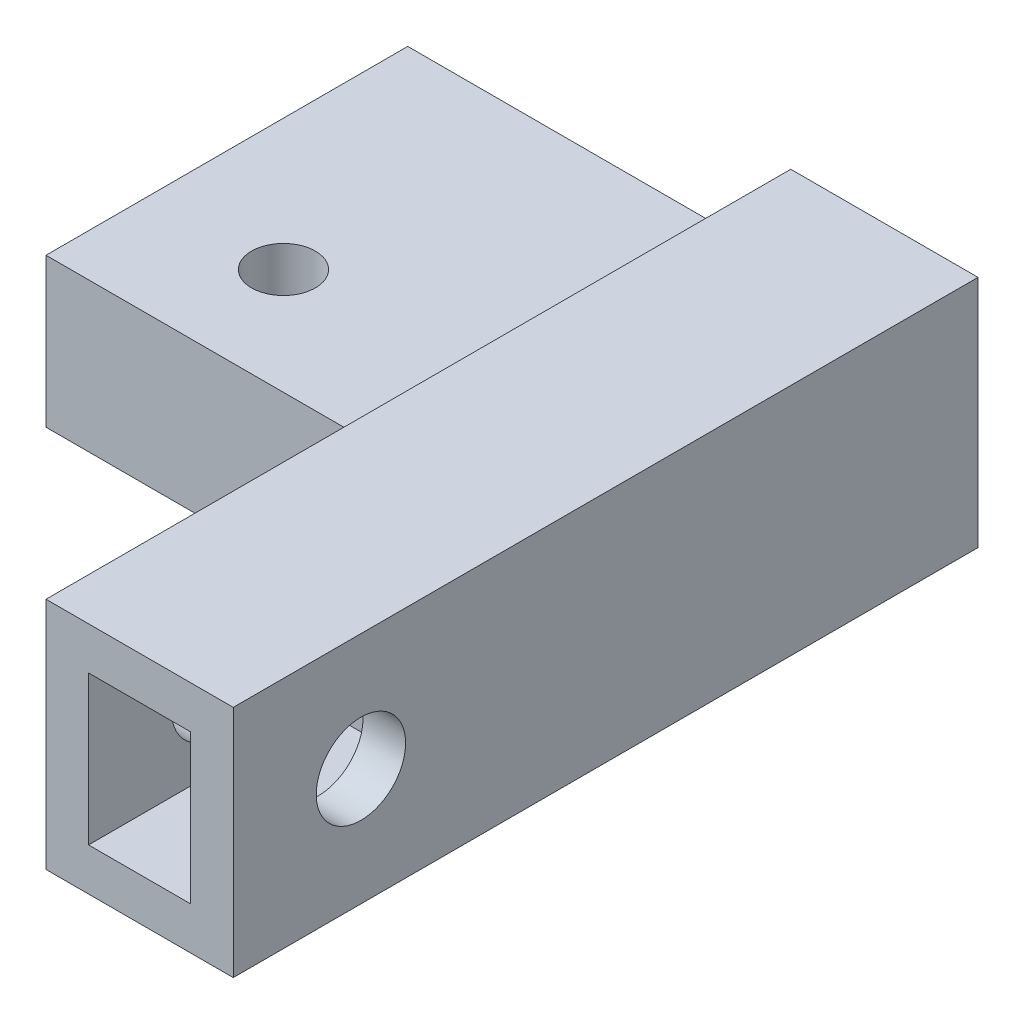
ISO-10303-21;
HEADER;
FILE_DESCRIPTION(('STEP AP214'),'2;1');
FILE_NAME('part.step','',(''),(''),'','','');
FILE_SCHEMA(('AUTOMOTIVE_DESIGN { 1 0 10303 214 1 1 1 1 }'));
ENDSEC;
DATA;
#1=APPLICATION_CONTEXT('core data for automotive mechanical design processes');
#2=APPLICATION_PROTOCOL_DEFINITION('international standard','automotive_design',2000,#1);
#3=PRODUCT_CONTEXT('',#1,'mechanical');
#4=PRODUCT('Part','Part','',(#3));
#5=PRODUCT_RELATED_PRODUCT_CATEGORY('part','',(#4));
#6=PRODUCT_DEFINITION_FORMATION('','',#4);
#7=PRODUCT_DEFINITION_CONTEXT('part definition',#1,'design');
#8=PRODUCT_DEFINITION('design','',#6,#7);
#9=PRODUCT_DEFINITION_SHAPE('','',#8);
#10=(LENGTH_UNIT() NAMED_UNIT(*) SI_UNIT(.MILLI.,.METRE.));
#11=(NAMED_UNIT(*) PLANE_ANGLE_UNIT() SI_UNIT($,.RADIAN.));
#12=(NAMED_UNIT(*) SI_UNIT($,.STERADIAN.) SOLID_ANGLE_UNIT());
#13=UNCERTAINTY_MEASURE_WITH_UNIT(LENGTH_MEASURE(1.E-05),#10,'distance_accuracy_value','');
#14=(GEOMETRIC_REPRESENTATION_CONTEXT(3) GLOBAL_UNCERTAINTY_ASSIGNED_CONTEXT((#13)) GLOBAL_UNIT_ASSIGNED_CONTEXT((#10,
#11,#12)) REPRESENTATION_CONTEXT('',''));
#15=CARTESIAN_POINT('',(0.,0.,0.));
#16=DIRECTION('',(0.,0.,1.));
#17=DIRECTION('',(1.,0.,0.));
#18=AXIS2_PLACEMENT_3D('',#15,#16,#17);
#19=CARTESIAN_POINT('',(4.4,5.5,-35.));
#20=DIRECTION('',(1.,0.,0.));
#21=DIRECTION('',(0.,1.,0.));
#22=AXIS2_PLACEMENT_3D('',#19,#20,#21);
#23=PLANE('',#22);
#24=CARTESIAN_POINT('',(4.40000000000001,0.,-6.));
#25=DIRECTION('',(1.,0.,0.));
#26=DIRECTION('',(0.,1.,0.));
#27=AXIS2_PLACEMENT_3D('',#24,#25,#26);
#28=CIRCLE('',#27,2.1);
#29=CARTESIAN_POINT('',(4.40000000000001,2.1,-6.));
#30=VERTEX_POINT('',#29);
#31=EDGE_CURVE('E166',#30,#30,#28,.T.);
#32=ORIENTED_EDGE('',*,*,#31,.F.);
#33=EDGE_LOOP('',(#32));
#34=FACE_BOUND('',#33,.T.);
#35=DIRECTION('',(0.,1.,0.));
#36=VECTOR('',#35,1.);
#37=CARTESIAN_POINT('',(4.4,5.5,0.));
#38=LINE('',#37,#36);
#39=CARTESIAN_POINT('',(4.40000000000001,-5.50000000000001,0.));
#40=VERTEX_POINT('',#39);
#41=CARTESIAN_POINT('',(4.4,5.5,0.));
#42=VERTEX_POINT('',#41);
#43=EDGE_CURVE('E195',#40,#42,#38,.T.);
#44=ORIENTED_EDGE('',*,*,#43,.F.);
#45=DIRECTION('',(0.,0.,1.));
#46=VECTOR('',#45,1.);
#47=CARTESIAN_POINT('',(4.40000000000001,-5.50000000000001,-35.));
#48=LINE('',#47,#46);
#49=CARTESIAN_POINT('',(4.40000000000001,-5.50000000000001,-35.));
#50=VERTEX_POINT('',#49);
#51=EDGE_CURVE('E11',#50,#40,#48,.T.);
#52=ORIENTED_EDGE('',*,*,#51,.F.);
#53=DIRECTION('',(0.,1.,0.));
#54=VECTOR('',#53,1.);
#55=CARTESIAN_POINT('',(4.4,5.5,-35.));
#56=LINE('',#55,#54);
#57=CARTESIAN_POINT('',(4.4,5.5,-35.));
#58=VERTEX_POINT('',#57);
#59=EDGE_CURVE('E125',#50,#58,#56,.T.);
#60=ORIENTED_EDGE('',*,*,#59,.T.);
#61=DIRECTION('',(0.,0.,1.));
#62=VECTOR('',#61,1.);
#63=CARTESIAN_POINT('',(4.4,5.5,-35.));
#64=LINE('',#63,#62);
#65=EDGE_CURVE('E127',#58,#42,#64,.T.);
#66=ORIENTED_EDGE('',*,*,#65,.T.);
#67=EDGE_LOOP('',(#44,#52,#60,#66));
#68=FACE_BOUND('',#67,.T.);
#69=ADVANCED_FACE('F34',(#34,#68),#23,.T.);
#70=CARTESIAN_POINT('',(-4.4,-5.50000000000001,-35.));
#71=DIRECTION('',(0.,-1.,0.));
#72=DIRECTION('',(0.,0.,-1.));
#73=AXIS2_PLACEMENT_3D('',#70,#71,#72);
#74=PLANE('',#73);
#75=DIRECTION('',(1.,0.,0.));
#76=VECTOR('',#75,1.);
#77=CARTESIAN_POINT('',(-4.4,-5.50000000000001,0.));
#78=LINE('',#77,#76);
#79=CARTESIAN_POINT('',(-4.4,-5.50000000000001,0.));
#80=VERTEX_POINT('',#79);
#81=EDGE_CURVE('E204',#80,#40,#78,.T.);
#82=ORIENTED_EDGE('',*,*,#81,.F.);
#83=DIRECTION('',(0.,0.,1.));
#84=VECTOR('',#83,1.);
#85=CARTESIAN_POINT('',(-4.4,-5.50000000000001,-35.));
#86=LINE('',#85,#84);
#87=CARTESIAN_POINT('',(-4.4,-5.50000000000001,-18.));
#88=VERTEX_POINT('',#87);
#89=EDGE_CURVE('E42',#88,#80,#86,.T.);
#90=ORIENTED_EDGE('',*,*,#89,.F.);
#91=DIRECTION('',(1.,0.,0.));
#92=VECTOR('',#91,1.);
#93=CARTESIAN_POINT('',(-22.4,-5.50000000000001,-18.));
#94=LINE('',#93,#92);
#95=CARTESIAN_POINT('',(-22.4,-5.50000000000001,-18.));
#96=VERTEX_POINT('',#95);
#97=EDGE_CURVE('E134',#96,#88,#94,.T.);
#98=ORIENTED_EDGE('',*,*,#97,.F.);
#99=DIRECTION('',(0.,0.,1.));
#100=VECTOR('',#99,1.);
#101=CARTESIAN_POINT('',(-22.4,-5.50000000000001,-35.));
#102=LINE('',#101,#100);
#103=CARTESIAN_POINT('',(-22.4,-5.50000000000001,-35.));
#104=VERTEX_POINT('',#103);
#105=EDGE_CURVE('E130',#104,#96,#102,.T.);
#106=ORIENTED_EDGE('',*,*,#105,.F.);
#107=DIRECTION('',(1.,0.,0.));
#108=VECTOR('',#107,1.);
#109=CARTESIAN_POINT('',(-4.4,-5.50000000000001,-35.));
#110=LINE('',#109,#108);
#111=EDGE_CURVE('E117',#104,#50,#110,.T.);
#112=ORIENTED_EDGE('',*,*,#111,.T.);
#113=ORIENTED_EDGE('',*,*,#51,.T.);
#114=EDGE_LOOP('',(#82,#90,#98,#106,#112,#113));
#115=FACE_BOUND('',#114,.T.);
#116=ADVANCED_FACE('F132',(#115),#74,.T.);
#117=CARTESIAN_POINT('',(-4.4,5.5,-35.));
#118=DIRECTION('',(-1.,0.,0.));
#119=DIRECTION('',(0.,-1.,0.));
#120=AXIS2_PLACEMENT_3D('',#117,#118,#119);
#121=PLANE('',#120);
#122=DIRECTION('',(0.,0.,-1.));
#123=VECTOR('',#122,1.);
#124=CARTESIAN_POINT('',(-4.4,1.49999999999999,-35.));
#125=LINE('',#124,#123);
#126=CARTESIAN_POINT('',(-4.4,1.49999999999999,-18.));
#127=VERTEX_POINT('',#126);
#128=CARTESIAN_POINT('',(-4.4,1.49999999999999,-35.));
#129=VERTEX_POINT('',#128);
#130=EDGE_CURVE('E143',#127,#129,#125,.T.);
#131=ORIENTED_EDGE('',*,*,#130,.F.);
#132=DIRECTION('',(0.,1.,0.));
#133=VECTOR('',#132,1.);
#134=CARTESIAN_POINT('',(-4.4,-5.50000000000001,-18.));
#135=LINE('',#134,#133);
#136=EDGE_CURVE('E50',#88,#127,#135,.T.);
#137=ORIENTED_EDGE('',*,*,#136,.F.);
#138=ORIENTED_EDGE('',*,*,#89,.T.);
#139=DIRECTION('',(0.,-1.,0.));
#140=VECTOR('',#139,1.);
#141=CARTESIAN_POINT('',(-4.4,5.5,0.));
#142=LINE('',#141,#140);
#143=CARTESIAN_POINT('',(-4.4,5.5,0.));
#144=VERTEX_POINT('',#143);
#145=EDGE_CURVE('E213',#144,#80,#142,.T.);
#146=ORIENTED_EDGE('',*,*,#145,.F.);
#147=DIRECTION('',(0.,0.,1.));
#148=VECTOR('',#147,1.);
#149=CARTESIAN_POINT('',(-4.4,5.5,-35.));
#150=LINE('',#149,#148);
#151=CARTESIAN_POINT('',(-4.4,5.5,-35.));
#152=VERTEX_POINT('',#151);
#153=EDGE_CURVE('E219',#152,#144,#150,.T.);
#154=ORIENTED_EDGE('',*,*,#153,.F.);
#155=DIRECTION('',(0.,-1.,0.));
#156=VECTOR('',#155,1.);
#157=CARTESIAN_POINT('',(-4.4,5.5,-35.));
#158=LINE('',#157,#156);
#159=EDGE_CURVE('E56',#152,#129,#158,.T.);
#160=ORIENTED_EDGE('',*,*,#159,.T.);
#161=EDGE_LOOP('',(#131,#137,#138,#146,#154,#160));
#162=FACE_BOUND('',#161,.T.);
#163=CARTESIAN_POINT('',(-4.4,0.,-6.));
#164=DIRECTION('',(-1.,0.,0.));
#165=DIRECTION('',(0.,-1.,0.));
#166=AXIS2_PLACEMENT_3D('',#163,#164,#165);
#167=CIRCLE('',#166,2.1);
#168=CARTESIAN_POINT('',(-4.4,-2.1,-6.));
#169=VERTEX_POINT('',#168);
#170=EDGE_CURVE('E160',#169,#169,#167,.T.);
#171=ORIENTED_EDGE('',*,*,#170,.F.);
#172=EDGE_LOOP('',(#171));
#173=FACE_BOUND('',#172,.T.);
#174=ADVANCED_FACE('F233',(#162,#173),#121,.T.);
#175=CARTESIAN_POINT('',(-4.4,5.5,-35.));
#176=DIRECTION('',(0.,1.,0.));
#177=DIRECTION('',(0.,0.,1.));
#178=AXIS2_PLACEMENT_3D('',#175,#176,#177);
#179=PLANE('',#178);
#180=DIRECTION('',(-1.,0.,0.));
#181=VECTOR('',#180,1.);
#182=CARTESIAN_POINT('',(-4.4,5.5,0.));
#183=LINE('',#182,#181);
#184=EDGE_CURVE('E210',#42,#144,#183,.T.);
#185=ORIENTED_EDGE('',*,*,#184,.F.);
#186=ORIENTED_EDGE('',*,*,#65,.F.);
#187=DIRECTION('',(-1.,0.,0.));
#188=VECTOR('',#187,1.);
#189=CARTESIAN_POINT('',(-4.4,5.5,-35.));
#190=LINE('',#189,#188);
#191=EDGE_CURVE('E203',#58,#152,#190,.T.);
#192=ORIENTED_EDGE('',*,*,#191,.T.);
#193=ORIENTED_EDGE('',*,*,#153,.T.);
#194=EDGE_LOOP('',(#185,#186,#192,#193));
#195=FACE_BOUND('',#194,.T.);
#196=ADVANCED_FACE('F224',(#195),#179,.T.);
#197=CARTESIAN_POINT('',(0.,0.,-35.));
#198=DIRECTION('',(0.,0.,1.));
#199=DIRECTION('',(1.,0.,0.));
#200=AXIS2_PLACEMENT_3D('',#197,#198,#199);
#201=PLANE('',#200);
#202=ORIENTED_EDGE('',*,*,#59,.F.);
#203=ORIENTED_EDGE('',*,*,#111,.F.);
#204=DIRECTION('',(0.,-1.,0.));
#205=VECTOR('',#204,1.);
#206=CARTESIAN_POINT('',(-22.4,-5.50000000000001,-35.));
#207=LINE('',#206,#205);
#208=CARTESIAN_POINT('',(-22.4,1.49999999999999,-35.));
#209=VERTEX_POINT('',#208);
#210=EDGE_CURVE('E122',#209,#104,#207,.T.);
#211=ORIENTED_EDGE('',*,*,#210,.F.);
#212=DIRECTION('',(1.,0.,0.));
#213=VECTOR('',#212,1.);
#214=CARTESIAN_POINT('',(-22.4,1.49999999999999,-35.));
#215=LINE('',#214,#213);
#216=EDGE_CURVE('E152',#209,#129,#215,.T.);
#217=ORIENTED_EDGE('',*,*,#216,.T.);
#218=ORIENTED_EDGE('',*,*,#159,.F.);
#219=ORIENTED_EDGE('',*,*,#191,.F.);
#220=EDGE_LOOP('',(#202,#203,#211,#217,#218,#219));
#221=FACE_BOUND('',#220,.T.);
#222=ADVANCED_FACE('F119',(#221),#201,.F.);
#223=CARTESIAN_POINT('',(0.,0.,0.));
#224=DIRECTION('',(0.,0.,1.));
#225=DIRECTION('',(1.,0.,0.));
#226=AXIS2_PLACEMENT_3D('',#223,#224,#225);
#227=PLANE('',#226);
#228=DIRECTION('',(0.,1.,0.));
#229=VECTOR('',#228,1.);
#230=CARTESIAN_POINT('',(2.4,3.5,0.));
#231=LINE('',#230,#229);
#232=CARTESIAN_POINT('',(2.4,-3.5,0.));
#233=VERTEX_POINT('',#232);
#234=CARTESIAN_POINT('',(2.4,3.5,0.));
#235=VERTEX_POINT('',#234);
#236=EDGE_CURVE('E169',#233,#235,#231,.T.);
#237=ORIENTED_EDGE('',*,*,#236,.F.);
#238=DIRECTION('',(1.,0.,0.));
#239=VECTOR('',#238,1.);
#240=CARTESIAN_POINT('',(-2.4,-3.5,0.));
#241=LINE('',#240,#239);
#242=CARTESIAN_POINT('',(-2.4,-3.5,0.));
#243=VERTEX_POINT('',#242);
#244=EDGE_CURVE('E174',#243,#233,#241,.T.);
#245=ORIENTED_EDGE('',*,*,#244,.F.);
#246=DIRECTION('',(0.,-1.,0.));
#247=VECTOR('',#246,1.);
#248=CARTESIAN_POINT('',(-2.4,3.5,0.));
#249=LINE('',#248,#247);
#250=CARTESIAN_POINT('',(-2.4,3.5,0.));
#251=VERTEX_POINT('',#250);
#252=EDGE_CURVE('E188',#251,#243,#249,.T.);
#253=ORIENTED_EDGE('',*,*,#252,.F.);
#254=DIRECTION('',(-1.,0.,0.));
#255=VECTOR('',#254,1.);
#256=CARTESIAN_POINT('',(-2.4,3.5,0.));
#257=LINE('',#256,#255);
#258=EDGE_CURVE('E185',#235,#251,#257,.T.);
#259=ORIENTED_EDGE('',*,*,#258,.F.);
#260=EDGE_LOOP('',(#237,#245,#253,#259));
#261=FACE_BOUND('',#260,.T.);
#262=ORIENTED_EDGE('',*,*,#43,.T.);
#263=ORIENTED_EDGE('',*,*,#184,.T.);
#264=ORIENTED_EDGE('',*,*,#145,.T.);
#265=ORIENTED_EDGE('',*,*,#81,.T.);
#266=EDGE_LOOP('',(#262,#263,#264,#265));
#267=FACE_BOUND('',#266,.T.);
#268=ADVANCED_FACE('F227',(#261,#267),#227,.T.);
#269=CARTESIAN_POINT('',(2.4,3.5,-11.));
#270=DIRECTION('',(1.,0.,0.));
#271=DIRECTION('',(0.,1.,0.));
#272=AXIS2_PLACEMENT_3D('',#269,#270,#271);
#273=PLANE('',#272);
#274=CARTESIAN_POINT('',(2.4,0.,-6.));
#275=DIRECTION('',(1.,0.,0.));
#276=DIRECTION('',(0.,1.,0.));
#277=AXIS2_PLACEMENT_3D('',#274,#275,#276);
#278=CIRCLE('',#277,2.1);
#279=CARTESIAN_POINT('',(2.4,2.1,-6.));
#280=VERTEX_POINT('',#279);
#281=EDGE_CURVE('E163',#280,#280,#278,.T.);
#282=ORIENTED_EDGE('',*,*,#281,.T.);
#283=EDGE_LOOP('',(#282));
#284=FACE_BOUND('',#283,.T.);
#285=ORIENTED_EDGE('',*,*,#236,.T.);
#286=DIRECTION('',(0.,0.,1.));
#287=VECTOR('',#286,1.);
#288=CARTESIAN_POINT('',(2.4,3.5,-11.));
#289=LINE('',#288,#287);
#290=CARTESIAN_POINT('',(2.4,3.5,-11.));
#291=VERTEX_POINT('',#290);
#292=EDGE_CURVE('E183',#291,#235,#289,.T.);
#293=ORIENTED_EDGE('',*,*,#292,.F.);
#294=DIRECTION('',(0.,1.,0.));
#295=VECTOR('',#294,1.);
#296=CARTESIAN_POINT('',(2.4,3.5,-11.));
#297=LINE('',#296,#295);
#298=CARTESIAN_POINT('',(2.4,-3.5,-11.));
#299=VERTEX_POINT('',#298);
#300=EDGE_CURVE('E170',#299,#291,#297,.T.);
#301=ORIENTED_EDGE('',*,*,#300,.F.);
#302=DIRECTION('',(0.,0.,1.));
#303=VECTOR('',#302,1.);
#304=CARTESIAN_POINT('',(2.4,-3.5,-11.));
#305=LINE('',#304,#303);
#306=EDGE_CURVE('E193',#299,#233,#305,.T.);
#307=ORIENTED_EDGE('',*,*,#306,.T.);
#308=EDGE_LOOP('',(#285,#293,#301,#307));
#309=FACE_BOUND('',#308,.T.);
#310=ADVANCED_FACE('F267',(#284,#309),#273,.F.);
#311=CARTESIAN_POINT('',(-2.4,-3.5,-11.));
#312=DIRECTION('',(0.,-1.,0.));
#313=DIRECTION('',(0.,0.,-1.));
#314=AXIS2_PLACEMENT_3D('',#311,#312,#313);
#315=PLANE('',#314);
#316=ORIENTED_EDGE('',*,*,#244,.T.);
#317=ORIENTED_EDGE('',*,*,#306,.F.);
#318=DIRECTION('',(1.,0.,0.));
#319=VECTOR('',#318,1.);
#320=CARTESIAN_POINT('',(-2.4,-3.5,-11.));
#321=LINE('',#320,#319);
#322=CARTESIAN_POINT('',(-2.4,-3.5,-11.));
#323=VERTEX_POINT('',#322);
#324=EDGE_CURVE('E180',#323,#299,#321,.T.);
#325=ORIENTED_EDGE('',*,*,#324,.F.);
#326=DIRECTION('',(0.,0.,1.));
#327=VECTOR('',#326,1.);
#328=CARTESIAN_POINT('',(-2.4,-3.5,-11.));
#329=LINE('',#328,#327);
#330=EDGE_CURVE('E196',#323,#243,#329,.T.);
#331=ORIENTED_EDGE('',*,*,#330,.T.);
#332=EDGE_LOOP('',(#316,#317,#325,#331));
#333=FACE_BOUND('',#332,.T.);
#334=ADVANCED_FACE('F252',(#333),#315,.F.);
#335=CARTESIAN_POINT('',(-2.4,3.5,-11.));
#336=DIRECTION('',(-1.,0.,0.));
#337=DIRECTION('',(0.,-1.,0.));
#338=AXIS2_PLACEMENT_3D('',#335,#336,#337);
#339=PLANE('',#338);
#340=CARTESIAN_POINT('',(-2.4,0.,-6.));
#341=DIRECTION('',(-1.,0.,0.));
#342=DIRECTION('',(0.,-1.,0.));
#343=AXIS2_PLACEMENT_3D('',#340,#341,#342);
#344=CIRCLE('',#343,2.1);
#345=CARTESIAN_POINT('',(-2.4,-2.1,-6.));
#346=VERTEX_POINT('',#345);
#347=EDGE_CURVE('E37',#346,#346,#344,.T.);
#348=ORIENTED_EDGE('',*,*,#347,.T.);
#349=EDGE_LOOP('',(#348));
#350=FACE_BOUND('',#349,.T.);
#351=ORIENTED_EDGE('',*,*,#252,.T.);
#352=ORIENTED_EDGE('',*,*,#330,.F.);
#353=DIRECTION('',(0.,-1.,0.));
#354=VECTOR('',#353,1.);
#355=CARTESIAN_POINT('',(-2.4,3.5,-11.));
#356=LINE('',#355,#354);
#357=CARTESIAN_POINT('',(-2.4,3.5,-11.));
#358=VERTEX_POINT('',#357);
#359=EDGE_CURVE('E177',#358,#323,#356,.T.);
#360=ORIENTED_EDGE('',*,*,#359,.F.);
#361=DIRECTION('',(0.,0.,1.));
#362=VECTOR('',#361,1.);
#363=CARTESIAN_POINT('',(-2.4,3.5,-11.));
#364=LINE('',#363,#362);
#365=EDGE_CURVE('E198',#358,#251,#364,.T.);
#366=ORIENTED_EDGE('',*,*,#365,.T.);
#367=EDGE_LOOP('',(#351,#352,#360,#366));
#368=FACE_BOUND('',#367,.T.);
#369=ADVANCED_FACE('F248',(#350,#368),#339,.F.);
#370=CARTESIAN_POINT('',(-2.4,3.5,-11.));
#371=DIRECTION('',(0.,1.,0.));
#372=DIRECTION('',(0.,0.,1.));
#373=AXIS2_PLACEMENT_3D('',#370,#371,#372);
#374=PLANE('',#373);
#375=ORIENTED_EDGE('',*,*,#258,.T.);
#376=ORIENTED_EDGE('',*,*,#365,.F.);
#377=DIRECTION('',(-1.,0.,0.));
#378=VECTOR('',#377,1.);
#379=CARTESIAN_POINT('',(-2.4,3.5,-11.));
#380=LINE('',#379,#378);
#381=EDGE_CURVE('E173',#291,#358,#380,.T.);
#382=ORIENTED_EDGE('',*,*,#381,.F.);
#383=ORIENTED_EDGE('',*,*,#292,.T.);
#384=EDGE_LOOP('',(#375,#376,#382,#383));
#385=FACE_BOUND('',#384,.T.);
#386=ADVANCED_FACE('F251',(#385),#374,.F.);
#387=CARTESIAN_POINT('',(0.,0.,-11.));
#388=DIRECTION('',(0.,0.,1.));
#389=DIRECTION('',(1.,0.,0.));
#390=AXIS2_PLACEMENT_3D('',#387,#388,#389);
#391=PLANE('',#390);
#392=ORIENTED_EDGE('',*,*,#300,.T.);
#393=ORIENTED_EDGE('',*,*,#381,.T.);
#394=ORIENTED_EDGE('',*,*,#359,.T.);
#395=ORIENTED_EDGE('',*,*,#324,.T.);
#396=EDGE_LOOP('',(#392,#393,#394,#395));
#397=FACE_BOUND('',#396,.T.);
#398=ADVANCED_FACE('F243',(#397),#391,.T.);
#399=CARTESIAN_POINT('',(6.6,0.,-6.));
#400=DIRECTION('',(-1.,0.,0.));
#401=DIRECTION('',(0.,-1.,0.));
#402=AXIS2_PLACEMENT_3D('',#399,#400,#401);
#403=CYLINDRICAL_SURFACE('',#402,2.1);
#404=ORIENTED_EDGE('',*,*,#170,.T.);
#405=EDGE_LOOP('',(#404));
#406=FACE_BOUND('',#405,.T.);
#407=ORIENTED_EDGE('',*,*,#347,.F.);
#408=EDGE_LOOP('',(#407));
#409=FACE_BOUND('',#408,.T.);
#410=ADVANCED_FACE('F239',(#406,#409),#403,.F.);
#411=ORIENTED_EDGE('',*,*,#31,.T.);
#412=EDGE_LOOP('',(#411));
#413=FACE_BOUND('',#412,.T.);
#414=ORIENTED_EDGE('',*,*,#281,.F.);
#415=EDGE_LOOP('',(#414));
#416=FACE_BOUND('',#415,.T.);
#417=ADVANCED_FACE('F242',(#413,#416),#403,.F.);
#418=CARTESIAN_POINT('',(-22.4,-5.50000000000001,-18.));
#419=DIRECTION('',(0.,0.,-1.));
#420=DIRECTION('',(-1.,0.,0.));
#421=AXIS2_PLACEMENT_3D('',#418,#419,#420);
#422=PLANE('',#421);
#423=ORIENTED_EDGE('',*,*,#136,.T.);
#424=DIRECTION('',(1.,0.,0.));
#425=VECTOR('',#424,1.);
#426=CARTESIAN_POINT('',(-22.4,1.49999999999999,-18.));
#427=LINE('',#426,#425);
#428=CARTESIAN_POINT('',(-22.4,1.49999999999999,-18.));
#429=VERTEX_POINT('',#428);
#430=EDGE_CURVE('E156',#429,#127,#427,.T.);
#431=ORIENTED_EDGE('',*,*,#430,.F.);
#432=DIRECTION('',(0.,1.,0.));
#433=VECTOR('',#432,1.);
#434=CARTESIAN_POINT('',(-22.4,-5.50000000000001,-18.));
#435=LINE('',#434,#433);
#436=EDGE_CURVE('E137',#96,#429,#435,.T.);
#437=ORIENTED_EDGE('',*,*,#436,.F.);
#438=ORIENTED_EDGE('',*,*,#97,.T.);
#439=EDGE_LOOP('',(#423,#431,#437,#438));
#440=FACE_BOUND('',#439,.T.);
#441=ADVANCED_FACE('F229',(#440),#422,.F.);
#442=CARTESIAN_POINT('',(-22.4,1.49999999999999,-35.));
#443=DIRECTION('',(0.,-1.,0.));
#444=DIRECTION('',(1.,0.,0.));
#445=AXIS2_PLACEMENT_3D('',#442,#443,#444);
#446=PLANE('',#445);
#447=CARTESIAN_POINT('',(-16.24,1.49999999999999,-23.));
#448=DIRECTION('',(0.,1.,0.));
#449=DIRECTION('',(-1.,0.,0.));
#450=AXIS2_PLACEMENT_3D('',#447,#448,#449);
#451=CIRCLE('',#450,1.5);
#452=CARTESIAN_POINT('',(-17.74,1.49999999999999,-23.));
#453=VERTEX_POINT('',#452);
#454=EDGE_CURVE('E147',#453,#453,#451,.T.);
#455=ORIENTED_EDGE('',*,*,#454,.F.);
#456=EDGE_LOOP('',(#455));
#457=FACE_BOUND('',#456,.T.);
#458=ORIENTED_EDGE('',*,*,#130,.T.);
#459=ORIENTED_EDGE('',*,*,#216,.F.);
#460=DIRECTION('',(0.,0.,-1.));
#461=VECTOR('',#460,1.);
#462=CARTESIAN_POINT('',(-22.4,1.49999999999999,-35.));
#463=LINE('',#462,#461);
#464=EDGE_CURVE('E141',#429,#209,#463,.T.);
#465=ORIENTED_EDGE('',*,*,#464,.F.);
#466=ORIENTED_EDGE('',*,*,#430,.T.);
#467=EDGE_LOOP('',(#458,#459,#465,#466));
#468=FACE_BOUND('',#467,.T.);
#469=ADVANCED_FACE('F232',(#457,#468),#446,.F.);
#470=CARTESIAN_POINT('',(-22.4,0.,0.));
#471=DIRECTION('',(1.,0.,0.));
#472=DIRECTION('',(0.,1.,0.));
#473=AXIS2_PLACEMENT_3D('',#470,#471,#472);
#474=PLANE('',#473);
#475=ORIENTED_EDGE('',*,*,#210,.T.);
#476=ORIENTED_EDGE('',*,*,#105,.T.);
#477=ORIENTED_EDGE('',*,*,#436,.T.);
#478=ORIENTED_EDGE('',*,*,#464,.T.);
#479=EDGE_LOOP('',(#475,#476,#477,#478));
#480=FACE_BOUND('',#479,.T.);
#481=ADVANCED_FACE('F139',(#480),#474,.F.);
#482=CARTESIAN_POINT('',(-16.24,-3.00000000000001,-23.));
#483=DIRECTION('',(0.,1.,0.));
#484=DIRECTION('',(-1.,0.,0.));
#485=AXIS2_PLACEMENT_3D('',#482,#483,#484);
#486=CYLINDRICAL_SURFACE('',#485,1.5);
#487=CARTESIAN_POINT('',(-16.24,-3.00000000000001,-23.));
#488=DIRECTION('',(0.,1.,0.));
#489=DIRECTION('',(-1.,0.,0.));
#490=AXIS2_PLACEMENT_3D('',#487,#488,#489);
#491=CIRCLE('',#490,1.5);
#492=CARTESIAN_POINT('',(-17.74,-3.00000000000001,-23.));
#493=VERTEX_POINT('',#492);
#494=EDGE_CURVE('E153',#493,#493,#491,.T.);
#495=ORIENTED_EDGE('',*,*,#494,.F.);
#496=EDGE_LOOP('',(#495));
#497=FACE_BOUND('',#496,.T.);
#498=ORIENTED_EDGE('',*,*,#454,.T.);
#499=EDGE_LOOP('',(#498));
#500=FACE_BOUND('',#499,.T.);
#501=ADVANCED_FACE('F357',(#497,#500),#486,.F.);
#502=CARTESIAN_POINT('',(-16.24,-3.00000000000001,-23.));
#503=DIRECTION('',(0.,1.,0.));
#504=DIRECTION('',(-1.,0.,0.));
#505=AXIS2_PLACEMENT_3D('',#502,#503,#504);
#506=PLANE('',#505);
#507=ORIENTED_EDGE('',*,*,#494,.T.);
#508=EDGE_LOOP('',(#507));
#509=FACE_BOUND('',#508,.T.);
#510=ADVANCED_FACE('F372',(#509),#506,.T.);
#511=CLOSED_SHELL('',(#69,#116,#174,#196,#222,#268,#310,#334,#369,#386,#398,#410,#417,#441,#469,
#481,#501,#510));
#512=MANIFOLD_SOLID_BREP('B2',#511);
#513=ADVANCED_BREP_SHAPE_REPRESENTATION('',(#18,#512),#14);
#514=SHAPE_DEFINITION_REPRESENTATION(#9,#513);
ENDSEC;
END-ISO-10303-21;
